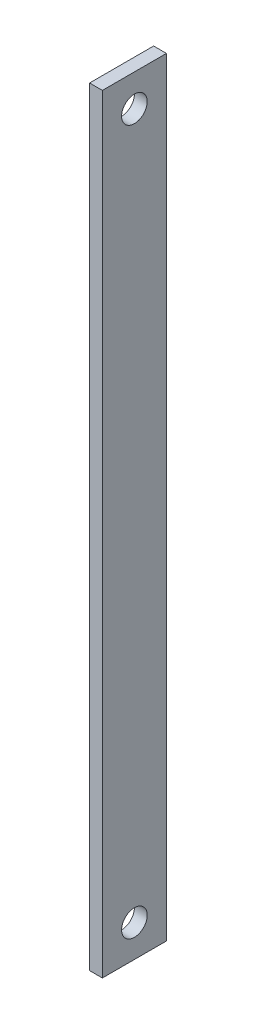
ISO-10303-21;
HEADER;
FILE_DESCRIPTION(('STEP AP214'),'2;1');
FILE_NAME('part.step','',(''),(''),'','','');
FILE_SCHEMA(('AUTOMOTIVE_DESIGN { 1 0 10303 214 1 1 1 1 }'));
ENDSEC;
DATA;
#1=APPLICATION_CONTEXT('core data for automotive mechanical design processes');
#2=APPLICATION_PROTOCOL_DEFINITION('international standard','automotive_design',2000,#1);
#3=PRODUCT_CONTEXT('',#1,'mechanical');
#4=PRODUCT('Part','Part','',(#3));
#5=PRODUCT_RELATED_PRODUCT_CATEGORY('part','',(#4));
#6=PRODUCT_DEFINITION_FORMATION('','',#4);
#7=PRODUCT_DEFINITION_CONTEXT('part definition',#1,'design');
#8=PRODUCT_DEFINITION('design','',#6,#7);
#9=PRODUCT_DEFINITION_SHAPE('','',#8);
#10=(LENGTH_UNIT() NAMED_UNIT(*) SI_UNIT(.MILLI.,.METRE.));
#11=(NAMED_UNIT(*) PLANE_ANGLE_UNIT() SI_UNIT($,.RADIAN.));
#12=(NAMED_UNIT(*) SI_UNIT($,.STERADIAN.) SOLID_ANGLE_UNIT());
#13=UNCERTAINTY_MEASURE_WITH_UNIT(LENGTH_MEASURE(1.E-05),#10,'distance_accuracy_value','');
#14=(GEOMETRIC_REPRESENTATION_CONTEXT(3) GLOBAL_UNCERTAINTY_ASSIGNED_CONTEXT((#13)) GLOBAL_UNIT_ASSIGNED_CONTEXT((#10,
#11,#12)) REPRESENTATION_CONTEXT('',''));
#15=CARTESIAN_POINT('',(0.,0.,0.));
#16=DIRECTION('',(0.,0.,1.));
#17=DIRECTION('',(1.,0.,0.));
#18=AXIS2_PLACEMENT_3D('',#15,#16,#17);
#19=CARTESIAN_POINT('',(2.,0.,0.));
#20=DIRECTION('',(-1.,0.,0.));
#21=DIRECTION('',(0.,0.,1.));
#22=AXIS2_PLACEMENT_3D('',#19,#20,#21);
#23=PLANE('',#22);
#24=DIRECTION('',(0.,-1.,0.));
#25=VECTOR('',#24,1.);
#26=CARTESIAN_POINT('',(2.,0.,0.));
#27=LINE('',#26,#25);
#28=CARTESIAN_POINT('',(2.,120.,0.));
#29=VERTEX_POINT('',#28);
#30=CARTESIAN_POINT('',(2.,0.,0.));
#31=VERTEX_POINT('',#30);
#32=EDGE_CURVE('E85',#29,#31,#27,.T.);
#33=ORIENTED_EDGE('',*,*,#32,.T.);
#34=DIRECTION('',(0.,0.,-1.));
#35=VECTOR('',#34,1.);
#36=CARTESIAN_POINT('',(2.,0.,0.));
#37=LINE('',#36,#35);
#38=CARTESIAN_POINT('',(2.,0.,-10.));
#39=VERTEX_POINT('',#38);
#40=EDGE_CURVE('E80',#31,#39,#37,.T.);
#41=ORIENTED_EDGE('',*,*,#40,.T.);
#42=DIRECTION('',(0.,1.,0.));
#43=VECTOR('',#42,1.);
#44=CARTESIAN_POINT('',(2.,0.,-10.));
#45=LINE('',#44,#43);
#46=CARTESIAN_POINT('',(2.,120.,-10.));
#47=VERTEX_POINT('',#46);
#48=EDGE_CURVE('E83',#39,#47,#45,.T.);
#49=ORIENTED_EDGE('',*,*,#48,.T.);
#50=DIRECTION('',(0.,0.,1.));
#51=VECTOR('',#50,1.);
#52=CARTESIAN_POINT('',(2.,120.,0.));
#53=LINE('',#52,#51);
#54=EDGE_CURVE('E50',#47,#29,#53,.T.);
#55=ORIENTED_EDGE('',*,*,#54,.T.);
#56=EDGE_LOOP('',(#33,#41,#49,#55));
#57=FACE_BOUND('',#56,.T.);
#58=CARTESIAN_POINT('',(2.,115.,-5.));
#59=DIRECTION('',(1.,0.,0.));
#60=DIRECTION('',(0.,0.,-1.));
#61=AXIS2_PLACEMENT_3D('',#58,#59,#60);
#62=CIRCLE('',#61,2.);
#63=CARTESIAN_POINT('',(2.,115.,-7.));
#64=VERTEX_POINT('',#63);
#65=EDGE_CURVE('E100',#64,#64,#62,.T.);
#66=ORIENTED_EDGE('',*,*,#65,.F.);
#67=EDGE_LOOP('',(#66));
#68=FACE_BOUND('',#67,.T.);
#69=CARTESIAN_POINT('',(2.,5.,-5.));
#70=DIRECTION('',(1.,0.,0.));
#71=DIRECTION('',(0.,0.,-1.));
#72=AXIS2_PLACEMENT_3D('',#69,#70,#71);
#73=CIRCLE('',#72,2.);
#74=CARTESIAN_POINT('',(2.,5.,-7.));
#75=VERTEX_POINT('',#74);
#76=EDGE_CURVE('E115',#75,#75,#73,.T.);
#77=ORIENTED_EDGE('',*,*,#76,.F.);
#78=EDGE_LOOP('',(#77));
#79=FACE_BOUND('',#78,.T.);
#80=ADVANCED_FACE('F33',(#57,#68,#79),#23,.F.);
#81=CARTESIAN_POINT('',(0.,0.,0.));
#82=DIRECTION('',(-1.,0.,0.));
#83=DIRECTION('',(0.,0.,1.));
#84=AXIS2_PLACEMENT_3D('',#81,#82,#83);
#85=PLANE('',#84);
#86=CARTESIAN_POINT('',(0.,115.,-5.));
#87=DIRECTION('',(1.,0.,0.));
#88=DIRECTION('',(0.,0.,-1.));
#89=AXIS2_PLACEMENT_3D('',#86,#87,#88);
#90=CIRCLE('',#89,2.);
#91=CARTESIAN_POINT('',(0.,115.,-7.));
#92=VERTEX_POINT('',#91);
#93=EDGE_CURVE('E112',#92,#92,#90,.T.);
#94=ORIENTED_EDGE('',*,*,#93,.T.);
#95=EDGE_LOOP('',(#94));
#96=FACE_BOUND('',#95,.T.);
#97=DIRECTION('',(0.,-1.,0.));
#98=VECTOR('',#97,1.);
#99=CARTESIAN_POINT('',(0.,0.,0.));
#100=LINE('',#99,#98);
#101=CARTESIAN_POINT('',(0.,120.,0.));
#102=VERTEX_POINT('',#101);
#103=CARTESIAN_POINT('',(0.,0.,0.));
#104=VERTEX_POINT('',#103);
#105=EDGE_CURVE('E97',#102,#104,#100,.T.);
#106=ORIENTED_EDGE('',*,*,#105,.F.);
#107=DIRECTION('',(0.,0.,1.));
#108=VECTOR('',#107,1.);
#109=CARTESIAN_POINT('',(0.,120.,0.));
#110=LINE('',#109,#108);
#111=CARTESIAN_POINT('',(0.,120.,-10.));
#112=VERTEX_POINT('',#111);
#113=EDGE_CURVE('E73',#112,#102,#110,.T.);
#114=ORIENTED_EDGE('',*,*,#113,.F.);
#115=DIRECTION('',(0.,1.,0.));
#116=VECTOR('',#115,1.);
#117=CARTESIAN_POINT('',(0.,0.,-10.));
#118=LINE('',#117,#116);
#119=CARTESIAN_POINT('',(0.,0.,-10.));
#120=VERTEX_POINT('',#119);
#121=EDGE_CURVE('E67',#120,#112,#118,.T.);
#122=ORIENTED_EDGE('',*,*,#121,.F.);
#123=DIRECTION('',(0.,0.,-1.));
#124=VECTOR('',#123,1.);
#125=CARTESIAN_POINT('',(0.,0.,0.));
#126=LINE('',#125,#124);
#127=EDGE_CURVE('E89',#104,#120,#126,.T.);
#128=ORIENTED_EDGE('',*,*,#127,.F.);
#129=EDGE_LOOP('',(#106,#114,#122,#128));
#130=FACE_BOUND('',#129,.T.);
#131=CARTESIAN_POINT('',(0.,5.,-5.));
#132=DIRECTION('',(1.,0.,0.));
#133=DIRECTION('',(0.,0.,-1.));
#134=AXIS2_PLACEMENT_3D('',#131,#132,#133);
#135=CIRCLE('',#134,2.);
#136=CARTESIAN_POINT('',(0.,5.,-7.));
#137=VERTEX_POINT('',#136);
#138=EDGE_CURVE('E118',#137,#137,#135,.T.);
#139=ORIENTED_EDGE('',*,*,#138,.T.);
#140=EDGE_LOOP('',(#139));
#141=FACE_BOUND('',#140,.T.);
#142=ADVANCED_FACE('F108',(#96,#130,#141),#85,.T.);
#143=CARTESIAN_POINT('',(2.,0.,0.));
#144=DIRECTION('',(0.,0.,-1.));
#145=DIRECTION('',(-1.,0.,0.));
#146=AXIS2_PLACEMENT_3D('',#143,#144,#145);
#147=PLANE('',#146);
#148=ORIENTED_EDGE('',*,*,#105,.T.);
#149=DIRECTION('',(-1.,0.,0.));
#150=VECTOR('',#149,1.);
#151=CARTESIAN_POINT('',(2.,0.,0.));
#152=LINE('',#151,#150);
#153=EDGE_CURVE('E11',#31,#104,#152,.T.);
#154=ORIENTED_EDGE('',*,*,#153,.F.);
#155=ORIENTED_EDGE('',*,*,#32,.F.);
#156=DIRECTION('',(-1.,0.,0.));
#157=VECTOR('',#156,1.);
#158=CARTESIAN_POINT('',(2.,120.,0.));
#159=LINE('',#158,#157);
#160=EDGE_CURVE('E93',#29,#102,#159,.T.);
#161=ORIENTED_EDGE('',*,*,#160,.T.);
#162=EDGE_LOOP('',(#148,#154,#155,#161));
#163=FACE_BOUND('',#162,.T.);
#164=ADVANCED_FACE('F35',(#163),#147,.F.);
#165=CARTESIAN_POINT('',(2.,0.,0.));
#166=DIRECTION('',(0.,1.,0.));
#167=DIRECTION('',(0.,0.,1.));
#168=AXIS2_PLACEMENT_3D('',#165,#166,#167);
#169=PLANE('',#168);
#170=ORIENTED_EDGE('',*,*,#127,.T.);
#171=DIRECTION('',(-1.,0.,0.));
#172=VECTOR('',#171,1.);
#173=CARTESIAN_POINT('',(2.,0.,-10.));
#174=LINE('',#173,#172);
#175=EDGE_CURVE('E42',#39,#120,#174,.T.);
#176=ORIENTED_EDGE('',*,*,#175,.F.);
#177=ORIENTED_EDGE('',*,*,#40,.F.);
#178=ORIENTED_EDGE('',*,*,#153,.T.);
#179=EDGE_LOOP('',(#170,#176,#177,#178));
#180=FACE_BOUND('',#179,.T.);
#181=ADVANCED_FACE('F88',(#180),#169,.F.);
#182=CARTESIAN_POINT('',(2.,0.,-10.));
#183=DIRECTION('',(0.,0.,1.));
#184=DIRECTION('',(1.,0.,0.));
#185=AXIS2_PLACEMENT_3D('',#182,#183,#184);
#186=PLANE('',#185);
#187=ORIENTED_EDGE('',*,*,#121,.T.);
#188=DIRECTION('',(-1.,0.,0.));
#189=VECTOR('',#188,1.);
#190=CARTESIAN_POINT('',(2.,120.,-10.));
#191=LINE('',#190,#189);
#192=EDGE_CURVE('E90',#47,#112,#191,.T.);
#193=ORIENTED_EDGE('',*,*,#192,.F.);
#194=ORIENTED_EDGE('',*,*,#48,.F.);
#195=ORIENTED_EDGE('',*,*,#175,.T.);
#196=EDGE_LOOP('',(#187,#193,#194,#195));
#197=FACE_BOUND('',#196,.T.);
#198=ADVANCED_FACE('F91',(#197),#186,.F.);
#199=CARTESIAN_POINT('',(2.,120.,0.));
#200=DIRECTION('',(0.,-1.,0.));
#201=DIRECTION('',(0.,0.,-1.));
#202=AXIS2_PLACEMENT_3D('',#199,#200,#201);
#203=PLANE('',#202);
#204=ORIENTED_EDGE('',*,*,#113,.T.);
#205=ORIENTED_EDGE('',*,*,#160,.F.);
#206=ORIENTED_EDGE('',*,*,#54,.F.);
#207=ORIENTED_EDGE('',*,*,#192,.T.);
#208=EDGE_LOOP('',(#204,#205,#206,#207));
#209=FACE_BOUND('',#208,.T.);
#210=ADVANCED_FACE('F105',(#209),#203,.F.);
#211=CARTESIAN_POINT('',(2.,115.,-5.));
#212=DIRECTION('',(-1.,0.,0.));
#213=DIRECTION('',(0.,0.,1.));
#214=AXIS2_PLACEMENT_3D('',#211,#212,#213);
#215=CYLINDRICAL_SURFACE('',#214,2.);
#216=ORIENTED_EDGE('',*,*,#65,.T.);
#217=EDGE_LOOP('',(#216));
#218=FACE_BOUND('',#217,.T.);
#219=ORIENTED_EDGE('',*,*,#93,.F.);
#220=EDGE_LOOP('',(#219));
#221=FACE_BOUND('',#220,.T.);
#222=ADVANCED_FACE('F135',(#218,#221),#215,.F.);
#223=CARTESIAN_POINT('',(2.,5.,-5.));
#224=DIRECTION('',(-1.,0.,0.));
#225=DIRECTION('',(0.,0.,1.));
#226=AXIS2_PLACEMENT_3D('',#223,#224,#225);
#227=CYLINDRICAL_SURFACE('',#226,2.);
#228=ORIENTED_EDGE('',*,*,#76,.T.);
#229=EDGE_LOOP('',(#228));
#230=FACE_BOUND('',#229,.T.);
#231=ORIENTED_EDGE('',*,*,#138,.F.);
#232=EDGE_LOOP('',(#231));
#233=FACE_BOUND('',#232,.T.);
#234=ADVANCED_FACE('F124',(#230,#233),#227,.F.);
#235=CLOSED_SHELL('',(#80,#142,#164,#181,#198,#210,#222,#234));
#236=MANIFOLD_SOLID_BREP('B2',#235);
#237=ADVANCED_BREP_SHAPE_REPRESENTATION('',(#18,#236),#14);
#238=SHAPE_DEFINITION_REPRESENTATION(#9,#237);
ENDSEC;
END-ISO-10303-21;
